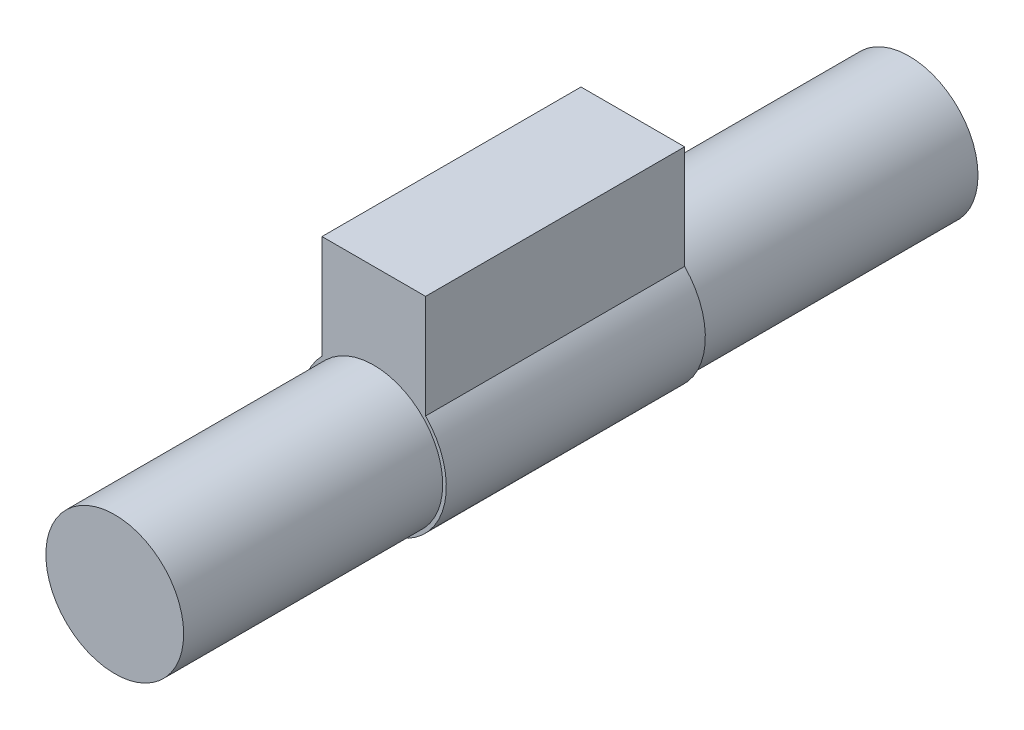
ISO-10303-21;
HEADER;
FILE_DESCRIPTION(('STEP AP214'),'2;1');
FILE_NAME('part.step','',(''),(''),'','','');
FILE_SCHEMA(('AUTOMOTIVE_DESIGN { 1 0 10303 214 1 1 1 1 }'));
ENDSEC;
DATA;
#1=APPLICATION_CONTEXT('core data for automotive mechanical design processes');
#2=APPLICATION_PROTOCOL_DEFINITION('international standard','automotive_design',2000,#1);
#3=PRODUCT_CONTEXT('',#1,'mechanical');
#4=PRODUCT('Part','Part','',(#3));
#5=PRODUCT_RELATED_PRODUCT_CATEGORY('part','',(#4));
#6=PRODUCT_DEFINITION_FORMATION('','',#4);
#7=PRODUCT_DEFINITION_CONTEXT('part definition',#1,'design');
#8=PRODUCT_DEFINITION('design','',#6,#7);
#9=PRODUCT_DEFINITION_SHAPE('','',#8);
#10=(LENGTH_UNIT() NAMED_UNIT(*) SI_UNIT(.MILLI.,.METRE.));
#11=(NAMED_UNIT(*) PLANE_ANGLE_UNIT() SI_UNIT($,.RADIAN.));
#12=(NAMED_UNIT(*) SI_UNIT($,.STERADIAN.) SOLID_ANGLE_UNIT());
#13=UNCERTAINTY_MEASURE_WITH_UNIT(LENGTH_MEASURE(1.E-05),#10,'distance_accuracy_value','');
#14=(GEOMETRIC_REPRESENTATION_CONTEXT(3) GLOBAL_UNCERTAINTY_ASSIGNED_CONTEXT((#13)) GLOBAL_UNIT_ASSIGNED_CONTEXT((#10,
#11,#12)) REPRESENTATION_CONTEXT('',''));
#15=CARTESIAN_POINT('',(0.,0.,0.));
#16=DIRECTION('',(0.,0.,1.));
#17=DIRECTION('',(1.,0.,0.));
#18=AXIS2_PLACEMENT_3D('',#15,#16,#17);
#19=CARTESIAN_POINT('',(-14.383915809038,-0.854852816609851,31.));
#20=DIRECTION('',(0.,0.,1.));
#21=DIRECTION('',(1.,0.,0.));
#22=AXIS2_PLACEMENT_3D('',#19,#20,#21);
#23=PLANE('',#22);
#24=CARTESIAN_POINT('',(-14.383915809038,-0.854852816609851,31.));
#25=DIRECTION('',(0.,0.,1.));
#26=DIRECTION('',(1.,0.,0.));
#27=AXIS2_PLACEMENT_3D('',#24,#25,#26);
#28=CIRCLE('',#27,4.2);
#29=CARTESIAN_POINT('',(-17.383915809038,2.08453487472996,31.));
#30=VERTEX_POINT('',#29);
#31=CARTESIAN_POINT('',(-11.383915809038,2.08453487472996,31.));
#32=VERTEX_POINT('',#31);
#33=EDGE_CURVE('E88',#30,#32,#28,.T.);
#34=ORIENTED_EDGE('',*,*,#33,.T.);
#35=DIRECTION('',(0.,1.,0.));
#36=VECTOR('',#35,1.);
#37=CARTESIAN_POINT('',(-11.383915809038,2.08453487472996,31.));
#38=LINE('',#37,#36);
#39=CARTESIAN_POINT('',(-11.383915809038,8.08453487472996,31.));
#40=VERTEX_POINT('',#39);
#41=EDGE_CURVE('E83',#32,#40,#38,.T.);
#42=ORIENTED_EDGE('',*,*,#41,.T.);
#43=DIRECTION('',(-1.,0.,0.));
#44=VECTOR('',#43,1.);
#45=CARTESIAN_POINT('',(-17.383915809038,8.08453487472996,31.));
#46=LINE('',#45,#44);
#47=CARTESIAN_POINT('',(-17.383915809038,8.08453487472996,31.));
#48=VERTEX_POINT('',#47);
#49=EDGE_CURVE('E86',#40,#48,#46,.T.);
#50=ORIENTED_EDGE('',*,*,#49,.T.);
#51=DIRECTION('',(0.,-1.,0.));
#52=VECTOR('',#51,1.);
#53=CARTESIAN_POINT('',(-17.383915809038,2.08453487472996,31.));
#54=LINE('',#53,#52);
#55=EDGE_CURVE('E52',#48,#30,#54,.T.);
#56=ORIENTED_EDGE('',*,*,#55,.T.);
#57=EDGE_LOOP('',(#34,#42,#50,#56));
#58=FACE_BOUND('',#57,.T.);
#59=CARTESIAN_POINT('',(-14.383915809038,-0.854852816609851,31.));
#60=DIRECTION('',(0.,0.,1.));
#61=DIRECTION('',(1.,0.,0.));
#62=AXIS2_PLACEMENT_3D('',#59,#60,#61);
#63=CIRCLE('',#62,3.99);
#64=CARTESIAN_POINT('',(-10.393915809038,-0.854852816609851,31.));
#65=VERTEX_POINT('',#64);
#66=EDGE_CURVE('E150',#65,#65,#63,.T.);
#67=ORIENTED_EDGE('',*,*,#66,.F.);
#68=EDGE_LOOP('',(#67));
#69=FACE_BOUND('',#68,.T.);
#70=ADVANCED_FACE('F35',(#58,#69),#23,.T.);
#71=CARTESIAN_POINT('',(-14.383915809038,-0.854852816609851,16.));
#72=DIRECTION('',(0.,0.,-1.));
#73=DIRECTION('',(-1.,0.,0.));
#74=AXIS2_PLACEMENT_3D('',#71,#72,#73);
#75=CYLINDRICAL_SURFACE('',#74,3.99);
#76=CARTESIAN_POINT('',(-14.383915809038,-0.854852816609851,16.));
#77=DIRECTION('',(0.,0.,1.));
#78=DIRECTION('',(1.,0.,0.));
#79=AXIS2_PLACEMENT_3D('',#76,#77,#78);
#80=CIRCLE('',#79,3.99);
#81=CARTESIAN_POINT('',(-10.393915809038,-0.854852816609851,16.));
#82=VERTEX_POINT('',#81);
#83=EDGE_CURVE('E11',#82,#82,#80,.T.);
#84=ORIENTED_EDGE('',*,*,#83,.F.);
#85=EDGE_LOOP('',(#84));
#86=FACE_BOUND('',#85,.T.);
#87=CARTESIAN_POINT('',(-14.383915809038,-0.854852816609851,0.));
#88=DIRECTION('',(0.,0.,1.));
#89=DIRECTION('',(1.,0.,0.));
#90=AXIS2_PLACEMENT_3D('',#87,#88,#89);
#91=CIRCLE('',#90,3.99);
#92=CARTESIAN_POINT('',(-10.393915809038,-0.854852816609851,0.));
#93=VERTEX_POINT('',#92);
#94=EDGE_CURVE('E39',#93,#93,#91,.T.);
#95=ORIENTED_EDGE('',*,*,#94,.T.);
#96=EDGE_LOOP('',(#95));
#97=FACE_BOUND('',#96,.T.);
#98=ADVANCED_FACE('F37',(#86,#97),#75,.T.);
#99=CARTESIAN_POINT('',(-14.383915809038,-0.854852816609851,0.));
#100=DIRECTION('',(0.,0.,1.));
#101=DIRECTION('',(1.,0.,0.));
#102=AXIS2_PLACEMENT_3D('',#99,#100,#101);
#103=PLANE('',#102);
#104=ORIENTED_EDGE('',*,*,#94,.F.);
#105=EDGE_LOOP('',(#104));
#106=FACE_BOUND('',#105,.T.);
#107=ADVANCED_FACE('F116',(#106),#103,.F.);
#108=CARTESIAN_POINT('',(-14.383915809038,-0.854852816609851,16.));
#109=DIRECTION('',(0.,0.,1.));
#110=DIRECTION('',(1.,0.,0.));
#111=AXIS2_PLACEMENT_3D('',#108,#109,#110);
#112=PLANE('',#111);
#113=CARTESIAN_POINT('',(-14.383915809038,-0.854852816609851,16.));
#114=DIRECTION('',(0.,0.,1.));
#115=DIRECTION('',(1.,0.,0.));
#116=AXIS2_PLACEMENT_3D('',#113,#114,#115);
#117=CIRCLE('',#116,4.2);
#118=CARTESIAN_POINT('',(-17.383915809038,2.08453487472996,16.));
#119=VERTEX_POINT('',#118);
#120=CARTESIAN_POINT('',(-11.383915809038,2.08453487472996,16.));
#121=VERTEX_POINT('',#120);
#122=EDGE_CURVE('E103',#119,#121,#117,.T.);
#123=ORIENTED_EDGE('',*,*,#122,.F.);
#124=DIRECTION('',(0.,-1.,0.));
#125=VECTOR('',#124,1.);
#126=CARTESIAN_POINT('',(-17.383915809038,2.08453487472996,16.));
#127=LINE('',#126,#125);
#128=CARTESIAN_POINT('',(-17.383915809038,8.08453487472996,16.));
#129=VERTEX_POINT('',#128);
#130=EDGE_CURVE('E75',#129,#119,#127,.T.);
#131=ORIENTED_EDGE('',*,*,#130,.F.);
#132=DIRECTION('',(-1.,0.,0.));
#133=VECTOR('',#132,1.);
#134=CARTESIAN_POINT('',(-17.383915809038,8.08453487472996,16.));
#135=LINE('',#134,#133);
#136=CARTESIAN_POINT('',(-11.383915809038,8.08453487472996,16.));
#137=VERTEX_POINT('',#136);
#138=EDGE_CURVE('E69',#137,#129,#135,.T.);
#139=ORIENTED_EDGE('',*,*,#138,.F.);
#140=DIRECTION('',(0.,1.,0.));
#141=VECTOR('',#140,1.);
#142=CARTESIAN_POINT('',(-11.383915809038,2.08453487472996,16.));
#143=LINE('',#142,#141);
#144=EDGE_CURVE('E93',#121,#137,#143,.T.);
#145=ORIENTED_EDGE('',*,*,#144,.F.);
#146=EDGE_LOOP('',(#123,#131,#139,#145));
#147=FACE_BOUND('',#146,.T.);
#148=ORIENTED_EDGE('',*,*,#83,.T.);
#149=EDGE_LOOP('',(#148));
#150=FACE_BOUND('',#149,.T.);
#151=ADVANCED_FACE('F118',(#147,#150),#112,.F.);
#152=CARTESIAN_POINT('',(-14.383915809038,-0.854852816609851,31.));
#153=DIRECTION('',(0.,0.,-1.));
#154=DIRECTION('',(-1.,0.,0.));
#155=AXIS2_PLACEMENT_3D('',#152,#153,#154);
#156=CYLINDRICAL_SURFACE('',#155,4.2);
#157=ORIENTED_EDGE('',*,*,#122,.T.);
#158=DIRECTION('',(0.,0.,-1.));
#159=VECTOR('',#158,1.);
#160=CARTESIAN_POINT('',(-11.383915809038,2.08453487472996,31.));
#161=LINE('',#160,#159);
#162=EDGE_CURVE('E94',#32,#121,#161,.T.);
#163=ORIENTED_EDGE('',*,*,#162,.F.);
#164=ORIENTED_EDGE('',*,*,#33,.F.);
#165=DIRECTION('',(0.,0.,-1.));
#166=VECTOR('',#165,1.);
#167=CARTESIAN_POINT('',(-17.383915809038,2.08453487472996,31.));
#168=LINE('',#167,#166);
#169=EDGE_CURVE('E99',#30,#119,#168,.T.);
#170=ORIENTED_EDGE('',*,*,#169,.T.);
#171=EDGE_LOOP('',(#157,#163,#164,#170));
#172=FACE_BOUND('',#171,.T.);
#173=ADVANCED_FACE('F123',(#172),#156,.T.);
#174=CARTESIAN_POINT('',(-11.383915809038,2.08453487472996,31.));
#175=DIRECTION('',(-1.,0.,0.));
#176=DIRECTION('',(0.,0.,1.));
#177=AXIS2_PLACEMENT_3D('',#174,#175,#176);
#178=PLANE('',#177);
#179=ORIENTED_EDGE('',*,*,#144,.T.);
#180=DIRECTION('',(0.,0.,-1.));
#181=VECTOR('',#180,1.);
#182=CARTESIAN_POINT('',(-11.383915809038,8.08453487472996,31.));
#183=LINE('',#182,#181);
#184=EDGE_CURVE('E91',#40,#137,#183,.T.);
#185=ORIENTED_EDGE('',*,*,#184,.F.);
#186=ORIENTED_EDGE('',*,*,#41,.F.);
#187=ORIENTED_EDGE('',*,*,#162,.T.);
#188=EDGE_LOOP('',(#179,#185,#186,#187));
#189=FACE_BOUND('',#188,.T.);
#190=ADVANCED_FACE('F92',(#189),#178,.F.);
#191=CARTESIAN_POINT('',(-17.383915809038,8.08453487472996,31.));
#192=DIRECTION('',(0.,-1.,0.));
#193=DIRECTION('',(0.,0.,-1.));
#194=AXIS2_PLACEMENT_3D('',#191,#192,#193);
#195=PLANE('',#194);
#196=ORIENTED_EDGE('',*,*,#138,.T.);
#197=DIRECTION('',(0.,0.,-1.));
#198=VECTOR('',#197,1.);
#199=CARTESIAN_POINT('',(-17.383915809038,8.08453487472996,31.));
#200=LINE('',#199,#198);
#201=EDGE_CURVE('E95',#48,#129,#200,.T.);
#202=ORIENTED_EDGE('',*,*,#201,.F.);
#203=ORIENTED_EDGE('',*,*,#49,.F.);
#204=ORIENTED_EDGE('',*,*,#184,.T.);
#205=EDGE_LOOP('',(#196,#202,#203,#204));
#206=FACE_BOUND('',#205,.T.);
#207=ADVANCED_FACE('F97',(#206),#195,.F.);
#208=CARTESIAN_POINT('',(-17.383915809038,2.08453487472996,31.));
#209=DIRECTION('',(1.,0.,0.));
#210=DIRECTION('',(0.,0.,-1.));
#211=AXIS2_PLACEMENT_3D('',#208,#209,#210);
#212=PLANE('',#211);
#213=ORIENTED_EDGE('',*,*,#130,.T.);
#214=ORIENTED_EDGE('',*,*,#169,.F.);
#215=ORIENTED_EDGE('',*,*,#55,.F.);
#216=ORIENTED_EDGE('',*,*,#201,.T.);
#217=EDGE_LOOP('',(#213,#214,#215,#216));
#218=FACE_BOUND('',#217,.T.);
#219=ADVANCED_FACE('F136',(#218),#212,.F.);
#220=CARTESIAN_POINT('',(-14.383915809038,-0.854852816609851,46.));
#221=DIRECTION('',(0.,0.,-1.));
#222=DIRECTION('',(-1.,0.,0.));
#223=AXIS2_PLACEMENT_3D('',#220,#221,#222);
#224=CYLINDRICAL_SURFACE('',#223,3.99);
#225=CARTESIAN_POINT('',(-14.383915809038,-0.854852816609851,46.));
#226=DIRECTION('',(0.,0.,1.));
#227=DIRECTION('',(1.,0.,0.));
#228=AXIS2_PLACEMENT_3D('',#225,#226,#227);
#229=CIRCLE('',#228,3.99);
#230=CARTESIAN_POINT('',(-10.393915809038,-0.854852816609851,46.));
#231=VERTEX_POINT('',#230);
#232=EDGE_CURVE('E106',#231,#231,#229,.T.);
#233=ORIENTED_EDGE('',*,*,#232,.F.);
#234=EDGE_LOOP('',(#233));
#235=FACE_BOUND('',#234,.T.);
#236=ORIENTED_EDGE('',*,*,#66,.T.);
#237=EDGE_LOOP('',(#236));
#238=FACE_BOUND('',#237,.T.);
#239=ADVANCED_FACE('F133',(#235,#238),#224,.T.);
#240=CARTESIAN_POINT('',(-14.383915809038,-0.854852816609851,46.));
#241=DIRECTION('',(0.,0.,1.));
#242=DIRECTION('',(1.,0.,0.));
#243=AXIS2_PLACEMENT_3D('',#240,#241,#242);
#244=PLANE('',#243);
#245=ORIENTED_EDGE('',*,*,#232,.T.);
#246=EDGE_LOOP('',(#245));
#247=FACE_BOUND('',#246,.T.);
#248=ADVANCED_FACE('F156',(#247),#244,.T.);
#249=CLOSED_SHELL('',(#70,#98,#107,#151,#173,#190,#207,#219,#239,#248));
#250=MANIFOLD_SOLID_BREP('B2',#249);
#251=ADVANCED_BREP_SHAPE_REPRESENTATION('',(#18,#250),#14);
#252=SHAPE_DEFINITION_REPRESENTATION(#9,#251);
ENDSEC;
END-ISO-10303-21;
